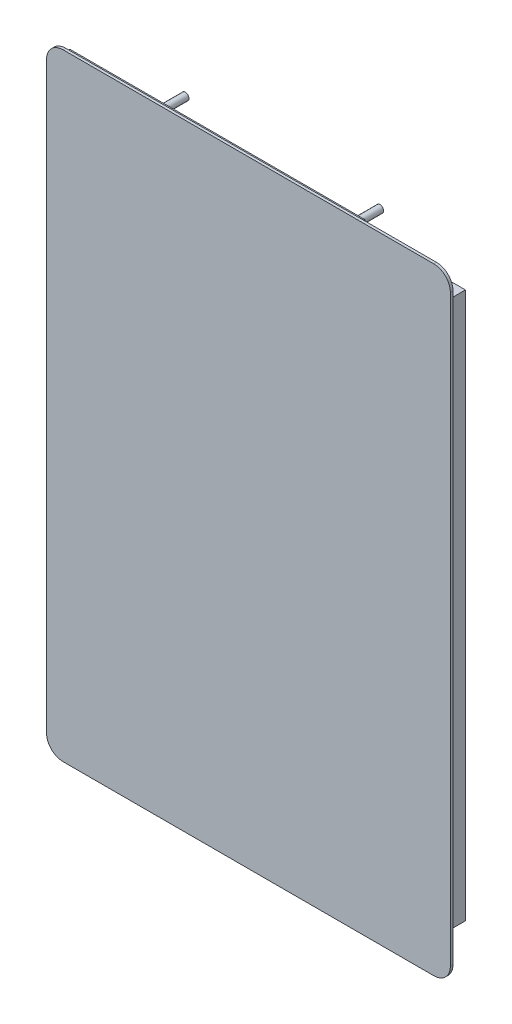
ISO-10303-21;
HEADER;
FILE_DESCRIPTION(('STEP AP214'),'2;1');
FILE_NAME('part.step','',(''),(''),'','','');
FILE_SCHEMA(('AUTOMOTIVE_DESIGN { 1 0 10303 214 1 1 1 1 }'));
ENDSEC;
DATA;
#1=APPLICATION_CONTEXT('core data for automotive mechanical design processes');
#2=APPLICATION_PROTOCOL_DEFINITION('international standard','automotive_design',2000,#1);
#3=PRODUCT_CONTEXT('',#1,'mechanical');
#4=PRODUCT('Part','Part','',(#3));
#5=PRODUCT_RELATED_PRODUCT_CATEGORY('part','',(#4));
#6=PRODUCT_DEFINITION_FORMATION('','',#4);
#7=PRODUCT_DEFINITION_CONTEXT('part definition',#1,'design');
#8=PRODUCT_DEFINITION('design','',#6,#7);
#9=PRODUCT_DEFINITION_SHAPE('','',#8);
#10=(LENGTH_UNIT() NAMED_UNIT(*) SI_UNIT(.MILLI.,.METRE.));
#11=(NAMED_UNIT(*) PLANE_ANGLE_UNIT() SI_UNIT($,.RADIAN.));
#12=(NAMED_UNIT(*) SI_UNIT($,.STERADIAN.) SOLID_ANGLE_UNIT());
#13=UNCERTAINTY_MEASURE_WITH_UNIT(LENGTH_MEASURE(1.E-05),#10,'distance_accuracy_value','');
#14=(GEOMETRIC_REPRESENTATION_CONTEXT(3) GLOBAL_UNCERTAINTY_ASSIGNED_CONTEXT((#13)) GLOBAL_UNIT_ASSIGNED_CONTEXT((#10,
#11,#12)) REPRESENTATION_CONTEXT('',''));
#15=CARTESIAN_POINT('',(0.,0.,0.));
#16=DIRECTION('',(0.,0.,1.));
#17=DIRECTION('',(1.,0.,0.));
#18=AXIS2_PLACEMENT_3D('',#15,#16,#17);
#19=CARTESIAN_POINT('',(76.67,120.67,0.));
#20=DIRECTION('',(0.,0.,-1.));
#21=DIRECTION('',(-1.,0.,0.));
#22=AXIS2_PLACEMENT_3D('',#19,#20,#21);
#23=PLANE('',#22);
#24=CARTESIAN_POINT('',(76.67,120.67,0.));
#25=DIRECTION('',(0.,0.,1.));
#26=DIRECTION('',(-1.,0.,0.));
#27=AXIS2_PLACEMENT_3D('',#24,#25,#26);
#28=CIRCLE('',#27,6.83);
#29=CARTESIAN_POINT('',(83.5,120.67,0.));
#30=VERTEX_POINT('',#29);
#31=CARTESIAN_POINT('',(76.6699999999999,127.5,0.));
#32=VERTEX_POINT('',#31);
#33=EDGE_CURVE('E255',#30,#32,#28,.T.);
#34=ORIENTED_EDGE('',*,*,#33,.F.);
#35=DIRECTION('',(0.,1.,0.));
#36=VECTOR('',#35,1.);
#37=CARTESIAN_POINT('',(83.5,-120.67,0.));
#38=LINE('',#37,#36);
#39=CARTESIAN_POINT('',(83.5,-120.67,0.));
#40=VERTEX_POINT('',#39);
#41=EDGE_CURVE('E261',#40,#30,#38,.T.);
#42=ORIENTED_EDGE('',*,*,#41,.F.);
#43=CARTESIAN_POINT('',(76.67,-120.67,0.));
#44=DIRECTION('',(0.,0.,1.));
#45=DIRECTION('',(1.,0.,0.));
#46=AXIS2_PLACEMENT_3D('',#43,#44,#45);
#47=CIRCLE('',#46,6.83);
#48=CARTESIAN_POINT('',(76.6699999999999,-127.5,0.));
#49=VERTEX_POINT('',#48);
#50=EDGE_CURVE('E301',#49,#40,#47,.T.);
#51=ORIENTED_EDGE('',*,*,#50,.F.);
#52=DIRECTION('',(1.,0.,0.));
#53=VECTOR('',#52,1.);
#54=CARTESIAN_POINT('',(-76.67,-127.5,0.));
#55=LINE('',#54,#53);
#56=CARTESIAN_POINT('',(-76.67,-127.5,0.));
#57=VERTEX_POINT('',#56);
#58=EDGE_CURVE('E298',#57,#49,#55,.T.);
#59=ORIENTED_EDGE('',*,*,#58,.F.);
#60=CARTESIAN_POINT('',(-76.67,-120.67,0.));
#61=DIRECTION('',(0.,0.,1.));
#62=DIRECTION('',(-1.,0.,0.));
#63=AXIS2_PLACEMENT_3D('',#60,#61,#62);
#64=CIRCLE('',#63,6.83);
#65=CARTESIAN_POINT('',(-83.5,-120.67,0.));
#66=VERTEX_POINT('',#65);
#67=EDGE_CURVE('E295',#66,#57,#64,.T.);
#68=ORIENTED_EDGE('',*,*,#67,.F.);
#69=DIRECTION('',(0.,-1.,0.));
#70=VECTOR('',#69,1.);
#71=CARTESIAN_POINT('',(-83.5,-120.67,0.));
#72=LINE('',#71,#70);
#73=CARTESIAN_POINT('',(-83.5,120.67,0.));
#74=VERTEX_POINT('',#73);
#75=EDGE_CURVE('E292',#74,#66,#72,.T.);
#76=ORIENTED_EDGE('',*,*,#75,.F.);
#77=CARTESIAN_POINT('',(-76.67,120.67,0.));
#78=DIRECTION('',(0.,0.,1.));
#79=DIRECTION('',(1.,0.,0.));
#80=AXIS2_PLACEMENT_3D('',#77,#78,#79);
#81=CIRCLE('',#80,6.83);
#82=CARTESIAN_POINT('',(-76.67,127.5,0.));
#83=VERTEX_POINT('',#82);
#84=EDGE_CURVE('E289',#83,#74,#81,.T.);
#85=ORIENTED_EDGE('',*,*,#84,.F.);
#86=DIRECTION('',(-1.,0.,0.));
#87=VECTOR('',#86,1.);
#88=CARTESIAN_POINT('',(-76.67,127.5,0.));
#89=LINE('',#88,#87);
#90=EDGE_CURVE('E286',#32,#83,#89,.T.);
#91=ORIENTED_EDGE('',*,*,#90,.F.);
#92=EDGE_LOOP('',(#34,#42,#51,#59,#68,#76,#85,#91));
#93=FACE_BOUND('',#92,.T.);
#94=DIRECTION('',(0.,-1.,0.));
#95=VECTOR('',#94,1.);
#96=CARTESIAN_POINT('',(78.04,113.,0.));
#97=LINE('',#96,#95);
#98=CARTESIAN_POINT('',(78.04,113.,0.));
#99=VERTEX_POINT('',#98);
#100=CARTESIAN_POINT('',(78.04,-113.,0.));
#101=VERTEX_POINT('',#100);
#102=EDGE_CURVE('E371',#99,#101,#97,.T.);
#103=ORIENTED_EDGE('',*,*,#102,.F.);
#104=DIRECTION('',(1.,0.,0.));
#105=VECTOR('',#104,1.);
#106=CARTESIAN_POINT('',(78.04,113.,0.));
#107=LINE('',#106,#105);
#108=CARTESIAN_POINT('',(46.04,113.,0.));
#109=VERTEX_POINT('',#108);
#110=EDGE_CURVE('E336',#109,#99,#107,.T.);
#111=ORIENTED_EDGE('',*,*,#110,.F.);
#112=DIRECTION('',(0.,-1.,0.));
#113=VECTOR('',#112,1.);
#114=CARTESIAN_POINT('',(46.04,127.,0.));
#115=LINE('',#114,#113);
#116=CARTESIAN_POINT('',(46.04,127.,0.));
#117=VERTEX_POINT('',#116);
#118=EDGE_CURVE('E82',#117,#109,#115,.T.);
#119=ORIENTED_EDGE('',*,*,#118,.F.);
#120=DIRECTION('',(1.,0.,0.));
#121=VECTOR('',#120,1.);
#122=CARTESIAN_POINT('',(46.04,127.,0.));
#123=LINE('',#122,#121);
#124=CARTESIAN_POINT('',(-75.96,127.,0.));
#125=VERTEX_POINT('',#124);
#126=EDGE_CURVE('E237',#125,#117,#123,.T.);
#127=ORIENTED_EDGE('',*,*,#126,.F.);
#128=DIRECTION('',(0.,1.,0.));
#129=VECTOR('',#128,1.);
#130=CARTESIAN_POINT('',(-75.96,127.,0.));
#131=LINE('',#130,#129);
#132=CARTESIAN_POINT('',(-75.96,-127.,0.));
#133=VERTEX_POINT('',#132);
#134=EDGE_CURVE('E233',#133,#125,#131,.T.);
#135=ORIENTED_EDGE('',*,*,#134,.F.);
#136=DIRECTION('',(-1.,0.,0.));
#137=VECTOR('',#136,1.);
#138=CARTESIAN_POINT('',(46.04,-127.,0.));
#139=LINE('',#138,#137);
#140=CARTESIAN_POINT('',(46.04,-127.,0.));
#141=VERTEX_POINT('',#140);
#142=EDGE_CURVE('E229',#141,#133,#139,.T.);
#143=ORIENTED_EDGE('',*,*,#142,.F.);
#144=CARTESIAN_POINT('',(46.04,-113.,0.));
#145=VERTEX_POINT('',#144);
#146=EDGE_CURVE('E204',#145,#141,#115,.T.);
#147=ORIENTED_EDGE('',*,*,#146,.F.);
#148=DIRECTION('',(-1.,0.,0.));
#149=VECTOR('',#148,1.);
#150=CARTESIAN_POINT('',(78.04,-113.,0.));
#151=LINE('',#150,#149);
#152=EDGE_CURVE('E198',#101,#145,#151,.T.);
#153=ORIENTED_EDGE('',*,*,#152,.F.);
#154=EDGE_LOOP('',(#103,#111,#119,#127,#135,#143,#147,#153));
#155=FACE_BOUND('',#154,.T.);
#156=ADVANCED_FACE('F56',(#93,#155),#23,.T.);
#157=CARTESIAN_POINT('',(46.04,127.,-1.));
#158=DIRECTION('',(-1.,0.,0.));
#159=DIRECTION('',(0.,-1.,0.));
#160=AXIS2_PLACEMENT_3D('',#157,#158,#159);
#161=PLANE('',#160);
#162=DIRECTION('',(0.,0.,1.));
#163=VECTOR('',#162,1.);
#164=CARTESIAN_POINT('',(46.04,113.,-10.6));
#165=LINE('',#164,#163);
#166=CARTESIAN_POINT('',(46.04,113.,-0.999999999999999));
#167=VERTEX_POINT('',#166);
#168=EDGE_CURVE('E205',#167,#109,#165,.T.);
#169=ORIENTED_EDGE('',*,*,#168,.F.);
#170=DIRECTION('',(0.,-1.,0.));
#171=VECTOR('',#170,1.);
#172=CARTESIAN_POINT('',(46.04,127.,-1.));
#173=LINE('',#172,#171);
#174=CARTESIAN_POINT('',(46.04,127.,-1.));
#175=VERTEX_POINT('',#174);
#176=EDGE_CURVE('E213',#175,#167,#173,.T.);
#177=ORIENTED_EDGE('',*,*,#176,.F.);
#178=DIRECTION('',(0.,0.,1.));
#179=VECTOR('',#178,1.);
#180=CARTESIAN_POINT('',(46.04,127.,-1.));
#181=LINE('',#180,#179);
#182=EDGE_CURVE('E226',#175,#117,#181,.T.);
#183=ORIENTED_EDGE('',*,*,#182,.T.);
#184=ORIENTED_EDGE('',*,*,#118,.T.);
#185=EDGE_LOOP('',(#169,#177,#183,#184));
#186=FACE_BOUND('',#185,.T.);
#187=ADVANCED_FACE('F405',(#186),#161,.F.);
#188=DIRECTION('',(0.,0.,1.));
#189=VECTOR('',#188,1.);
#190=CARTESIAN_POINT('',(46.04,-113.,-10.6));
#191=LINE('',#190,#189);
#192=CARTESIAN_POINT('',(46.04,-113.,-1.));
#193=VERTEX_POINT('',#192);
#194=EDGE_CURVE('E368',#193,#145,#191,.T.);
#195=ORIENTED_EDGE('',*,*,#194,.T.);
#196=ORIENTED_EDGE('',*,*,#146,.T.);
#197=DIRECTION('',(0.,0.,1.));
#198=VECTOR('',#197,1.);
#199=CARTESIAN_POINT('',(46.04,-127.,-1.));
#200=LINE('',#199,#198);
#201=CARTESIAN_POINT('',(46.04,-127.,-1.));
#202=VERTEX_POINT('',#201);
#203=EDGE_CURVE('E251',#202,#141,#200,.T.);
#204=ORIENTED_EDGE('',*,*,#203,.F.);
#205=EDGE_CURVE('E218',#193,#202,#173,.T.);
#206=ORIENTED_EDGE('',*,*,#205,.F.);
#207=EDGE_LOOP('',(#195,#196,#204,#206));
#208=FACE_BOUND('',#207,.T.);
#209=ADVANCED_FACE('F393',(#208),#161,.F.);
#210=CARTESIAN_POINT('',(76.67,120.67,1.1));
#211=DIRECTION('',(0.,0.,-1.));
#212=DIRECTION('',(-1.,0.,0.));
#213=AXIS2_PLACEMENT_3D('',#210,#211,#212);
#214=CYLINDRICAL_SURFACE('',#213,6.83);
#215=ORIENTED_EDGE('',*,*,#33,.T.);
#216=DIRECTION('',(0.,0.,-1.));
#217=VECTOR('',#216,1.);
#218=CARTESIAN_POINT('',(76.6699999999999,127.5,1.1));
#219=LINE('',#218,#217);
#220=CARTESIAN_POINT('',(76.6699999999999,127.5,1.1));
#221=VERTEX_POINT('',#220);
#222=EDGE_CURVE('E14',#221,#32,#219,.T.);
#223=ORIENTED_EDGE('',*,*,#222,.F.);
#224=CARTESIAN_POINT('',(76.67,120.67,1.1));
#225=DIRECTION('',(0.,0.,1.));
#226=DIRECTION('',(-1.,0.,0.));
#227=AXIS2_PLACEMENT_3D('',#224,#225,#226);
#228=CIRCLE('',#227,6.83);
#229=CARTESIAN_POINT('',(83.5,120.67,1.1));
#230=VERTEX_POINT('',#229);
#231=EDGE_CURVE('E256',#230,#221,#228,.T.);
#232=ORIENTED_EDGE('',*,*,#231,.F.);
#233=DIRECTION('',(0.,0.,-1.));
#234=VECTOR('',#233,1.);
#235=CARTESIAN_POINT('',(83.5,120.67,1.1));
#236=LINE('',#235,#234);
#237=EDGE_CURVE('E282',#230,#30,#236,.T.);
#238=ORIENTED_EDGE('',*,*,#237,.T.);
#239=EDGE_LOOP('',(#215,#223,#232,#238));
#240=FACE_BOUND('',#239,.T.);
#241=ADVANCED_FACE('F58',(#240),#214,.T.);
#242=CARTESIAN_POINT('',(-76.67,127.5,1.1));
#243=DIRECTION('',(0.,-1.,0.));
#244=DIRECTION('',(0.,0.,-1.));
#245=AXIS2_PLACEMENT_3D('',#242,#243,#244);
#246=PLANE('',#245);
#247=ORIENTED_EDGE('',*,*,#90,.T.);
#248=DIRECTION('',(0.,0.,-1.));
#249=VECTOR('',#248,1.);
#250=CARTESIAN_POINT('',(-76.67,127.5,1.1));
#251=LINE('',#250,#249);
#252=CARTESIAN_POINT('',(-76.67,127.5,1.1));
#253=VERTEX_POINT('',#252);
#254=EDGE_CURVE('E66',#253,#83,#251,.T.);
#255=ORIENTED_EDGE('',*,*,#254,.F.);
#256=DIRECTION('',(-1.,0.,0.));
#257=VECTOR('',#256,1.);
#258=CARTESIAN_POINT('',(-76.67,127.5,1.1));
#259=LINE('',#258,#257);
#260=EDGE_CURVE('E260',#221,#253,#259,.T.);
#261=ORIENTED_EDGE('',*,*,#260,.F.);
#262=ORIENTED_EDGE('',*,*,#222,.T.);
#263=EDGE_LOOP('',(#247,#255,#261,#262));
#264=FACE_BOUND('',#263,.T.);
#265=ADVANCED_FACE('F456',(#264),#246,.F.);
#266=CARTESIAN_POINT('',(-76.67,120.67,1.1));
#267=DIRECTION('',(0.,0.,-1.));
#268=DIRECTION('',(-1.,0.,0.));
#269=AXIS2_PLACEMENT_3D('',#266,#267,#268);
#270=CYLINDRICAL_SURFACE('',#269,6.83);
#271=ORIENTED_EDGE('',*,*,#84,.T.);
#272=DIRECTION('',(0.,0.,-1.));
#273=VECTOR('',#272,1.);
#274=CARTESIAN_POINT('',(-83.5,120.67,1.1));
#275=LINE('',#274,#273);
#276=CARTESIAN_POINT('',(-83.5,120.67,1.1));
#277=VERTEX_POINT('',#276);
#278=EDGE_CURVE('E325',#277,#74,#275,.T.);
#279=ORIENTED_EDGE('',*,*,#278,.F.);
#280=CARTESIAN_POINT('',(-76.67,120.67,1.1));
#281=DIRECTION('',(0.,0.,1.));
#282=DIRECTION('',(1.,0.,0.));
#283=AXIS2_PLACEMENT_3D('',#280,#281,#282);
#284=CIRCLE('',#283,6.83);
#285=EDGE_CURVE('E264',#253,#277,#284,.T.);
#286=ORIENTED_EDGE('',*,*,#285,.F.);
#287=ORIENTED_EDGE('',*,*,#254,.T.);
#288=EDGE_LOOP('',(#271,#279,#286,#287));
#289=FACE_BOUND('',#288,.T.);
#290=ADVANCED_FACE('F453',(#289),#270,.T.);
#291=CARTESIAN_POINT('',(-83.5,-120.67,1.1));
#292=DIRECTION('',(1.,0.,0.));
#293=DIRECTION('',(0.,0.,-1.));
#294=AXIS2_PLACEMENT_3D('',#291,#292,#293);
#295=PLANE('',#294);
#296=ORIENTED_EDGE('',*,*,#75,.T.);
#297=DIRECTION('',(0.,0.,-1.));
#298=VECTOR('',#297,1.);
#299=CARTESIAN_POINT('',(-83.5,-120.67,1.1));
#300=LINE('',#299,#298);
#301=CARTESIAN_POINT('',(-83.5,-120.67,1.1));
#302=VERTEX_POINT('',#301);
#303=EDGE_CURVE('E321',#302,#66,#300,.T.);
#304=ORIENTED_EDGE('',*,*,#303,.F.);
#305=DIRECTION('',(0.,-1.,0.));
#306=VECTOR('',#305,1.);
#307=CARTESIAN_POINT('',(-83.5,-120.67,1.1));
#308=LINE('',#307,#306);
#309=EDGE_CURVE('E267',#277,#302,#308,.T.);
#310=ORIENTED_EDGE('',*,*,#309,.F.);
#311=ORIENTED_EDGE('',*,*,#278,.T.);
#312=EDGE_LOOP('',(#296,#304,#310,#311));
#313=FACE_BOUND('',#312,.T.);
#314=ADVANCED_FACE('F449',(#313),#295,.F.);
#315=CARTESIAN_POINT('',(-76.67,-120.67,1.1));
#316=DIRECTION('',(0.,0.,-1.));
#317=DIRECTION('',(-1.,0.,0.));
#318=AXIS2_PLACEMENT_3D('',#315,#316,#317);
#319=CYLINDRICAL_SURFACE('',#318,6.83);
#320=ORIENTED_EDGE('',*,*,#67,.T.);
#321=DIRECTION('',(0.,0.,-1.));
#322=VECTOR('',#321,1.);
#323=CARTESIAN_POINT('',(-76.67,-127.5,1.1));
#324=LINE('',#323,#322);
#325=CARTESIAN_POINT('',(-76.67,-127.5,1.1));
#326=VERTEX_POINT('',#325);
#327=EDGE_CURVE('E317',#326,#57,#324,.T.);
#328=ORIENTED_EDGE('',*,*,#327,.F.);
#329=CARTESIAN_POINT('',(-76.67,-120.67,1.1));
#330=DIRECTION('',(0.,0.,1.));
#331=DIRECTION('',(-1.,0.,0.));
#332=AXIS2_PLACEMENT_3D('',#329,#330,#331);
#333=CIRCLE('',#332,6.83);
#334=EDGE_CURVE('E270',#302,#326,#333,.T.);
#335=ORIENTED_EDGE('',*,*,#334,.F.);
#336=ORIENTED_EDGE('',*,*,#303,.T.);
#337=EDGE_LOOP('',(#320,#328,#335,#336));
#338=FACE_BOUND('',#337,.T.);
#339=ADVANCED_FACE('F445',(#338),#319,.T.);
#340=CARTESIAN_POINT('',(-76.67,-127.5,1.1));
#341=DIRECTION('',(0.,1.,0.));
#342=DIRECTION('',(0.,0.,1.));
#343=AXIS2_PLACEMENT_3D('',#340,#341,#342);
#344=PLANE('',#343);
#345=ORIENTED_EDGE('',*,*,#58,.T.);
#346=DIRECTION('',(0.,0.,-1.));
#347=VECTOR('',#346,1.);
#348=CARTESIAN_POINT('',(76.6699999999999,-127.5,1.1));
#349=LINE('',#348,#347);
#350=CARTESIAN_POINT('',(76.6699999999999,-127.5,1.1));
#351=VERTEX_POINT('',#350);
#352=EDGE_CURVE('E313',#351,#49,#349,.T.);
#353=ORIENTED_EDGE('',*,*,#352,.F.);
#354=DIRECTION('',(1.,0.,0.));
#355=VECTOR('',#354,1.);
#356=CARTESIAN_POINT('',(-76.67,-127.5,1.1));
#357=LINE('',#356,#355);
#358=EDGE_CURVE('E273',#326,#351,#357,.T.);
#359=ORIENTED_EDGE('',*,*,#358,.F.);
#360=ORIENTED_EDGE('',*,*,#327,.T.);
#361=EDGE_LOOP('',(#345,#353,#359,#360));
#362=FACE_BOUND('',#361,.T.);
#363=ADVANCED_FACE('F441',(#362),#344,.F.);
#364=CARTESIAN_POINT('',(76.67,-120.67,1.1));
#365=DIRECTION('',(0.,0.,-1.));
#366=DIRECTION('',(-1.,0.,0.));
#367=AXIS2_PLACEMENT_3D('',#364,#365,#366);
#368=CYLINDRICAL_SURFACE('',#367,6.83);
#369=ORIENTED_EDGE('',*,*,#50,.T.);
#370=DIRECTION('',(0.,0.,-1.));
#371=VECTOR('',#370,1.);
#372=CARTESIAN_POINT('',(83.5,-120.67,1.1));
#373=LINE('',#372,#371);
#374=CARTESIAN_POINT('',(83.5,-120.67,1.1));
#375=VERTEX_POINT('',#374);
#376=EDGE_CURVE('E309',#375,#40,#373,.T.);
#377=ORIENTED_EDGE('',*,*,#376,.F.);
#378=CARTESIAN_POINT('',(76.67,-120.67,1.1));
#379=DIRECTION('',(0.,0.,1.));
#380=DIRECTION('',(1.,0.,0.));
#381=AXIS2_PLACEMENT_3D('',#378,#379,#380);
#382=CIRCLE('',#381,6.83);
#383=EDGE_CURVE('E276',#351,#375,#382,.T.);
#384=ORIENTED_EDGE('',*,*,#383,.F.);
#385=ORIENTED_EDGE('',*,*,#352,.T.);
#386=EDGE_LOOP('',(#369,#377,#384,#385));
#387=FACE_BOUND('',#386,.T.);
#388=ADVANCED_FACE('F437',(#387),#368,.T.);
#389=CARTESIAN_POINT('',(83.5,-120.67,1.1));
#390=DIRECTION('',(-1.,0.,0.));
#391=DIRECTION('',(0.,0.,1.));
#392=AXIS2_PLACEMENT_3D('',#389,#390,#391);
#393=PLANE('',#392);
#394=ORIENTED_EDGE('',*,*,#41,.T.);
#395=ORIENTED_EDGE('',*,*,#237,.F.);
#396=DIRECTION('',(0.,1.,0.));
#397=VECTOR('',#396,1.);
#398=CARTESIAN_POINT('',(83.5,-120.67,1.1));
#399=LINE('',#398,#397);
#400=EDGE_CURVE('E279',#375,#230,#399,.T.);
#401=ORIENTED_EDGE('',*,*,#400,.F.);
#402=ORIENTED_EDGE('',*,*,#376,.T.);
#403=EDGE_LOOP('',(#394,#395,#401,#402));
#404=FACE_BOUND('',#403,.T.);
#405=ADVANCED_FACE('F423',(#404),#393,.F.);
#406=CARTESIAN_POINT('',(76.67,120.67,1.1));
#407=DIRECTION('',(0.,0.,-1.));
#408=DIRECTION('',(-1.,0.,0.));
#409=AXIS2_PLACEMENT_3D('',#406,#407,#408);
#410=PLANE('',#409);
#411=ORIENTED_EDGE('',*,*,#231,.T.);
#412=ORIENTED_EDGE('',*,*,#260,.T.);
#413=ORIENTED_EDGE('',*,*,#285,.T.);
#414=ORIENTED_EDGE('',*,*,#309,.T.);
#415=ORIENTED_EDGE('',*,*,#334,.T.);
#416=ORIENTED_EDGE('',*,*,#358,.T.);
#417=ORIENTED_EDGE('',*,*,#383,.T.);
#418=ORIENTED_EDGE('',*,*,#400,.T.);
#419=EDGE_LOOP('',(#411,#412,#413,#414,#415,#416,#417,#418));
#420=FACE_BOUND('',#419,.T.);
#421=ADVANCED_FACE('F416',(#420),#410,.F.);
#422=CARTESIAN_POINT('',(46.04,-127.,-1.));
#423=DIRECTION('',(0.,1.,0.));
#424=DIRECTION('',(-1.,0.,0.));
#425=AXIS2_PLACEMENT_3D('',#422,#423,#424);
#426=PLANE('',#425);
#427=ORIENTED_EDGE('',*,*,#142,.T.);
#428=DIRECTION('',(0.,0.,1.));
#429=VECTOR('',#428,1.);
#430=CARTESIAN_POINT('',(-75.96,-127.,-1.));
#431=LINE('',#430,#429);
#432=CARTESIAN_POINT('',(-75.96,-127.,-1.));
#433=VERTEX_POINT('',#432);
#434=EDGE_CURVE('E247',#433,#133,#431,.T.);
#435=ORIENTED_EDGE('',*,*,#434,.F.);
#436=DIRECTION('',(-1.,0.,0.));
#437=VECTOR('',#436,1.);
#438=CARTESIAN_POINT('',(46.04,-127.,-1.));
#439=LINE('',#438,#437);
#440=EDGE_CURVE('E217',#202,#433,#439,.T.);
#441=ORIENTED_EDGE('',*,*,#440,.F.);
#442=ORIENTED_EDGE('',*,*,#203,.T.);
#443=EDGE_LOOP('',(#427,#435,#441,#442));
#444=FACE_BOUND('',#443,.T.);
#445=ADVANCED_FACE('F414',(#444),#426,.F.);
#446=CARTESIAN_POINT('',(-75.96,127.,-1.));
#447=DIRECTION('',(1.,0.,0.));
#448=DIRECTION('',(0.,1.,0.));
#449=AXIS2_PLACEMENT_3D('',#446,#447,#448);
#450=PLANE('',#449);
#451=ORIENTED_EDGE('',*,*,#134,.T.);
#452=DIRECTION('',(0.,0.,1.));
#453=VECTOR('',#452,1.);
#454=CARTESIAN_POINT('',(-75.96,127.,-1.));
#455=LINE('',#454,#453);
#456=CARTESIAN_POINT('',(-75.96,127.,-1.));
#457=VERTEX_POINT('',#456);
#458=EDGE_CURVE('E243',#457,#125,#455,.T.);
#459=ORIENTED_EDGE('',*,*,#458,.F.);
#460=DIRECTION('',(0.,1.,0.));
#461=VECTOR('',#460,1.);
#462=CARTESIAN_POINT('',(-75.96,127.,-1.));
#463=LINE('',#462,#461);
#464=EDGE_CURVE('E221',#433,#457,#463,.T.);
#465=ORIENTED_EDGE('',*,*,#464,.F.);
#466=ORIENTED_EDGE('',*,*,#434,.T.);
#467=EDGE_LOOP('',(#451,#459,#465,#466));
#468=FACE_BOUND('',#467,.T.);
#469=ADVANCED_FACE('F410',(#468),#450,.F.);
#470=CARTESIAN_POINT('',(46.04,127.,-1.));
#471=DIRECTION('',(0.,-1.,0.));
#472=DIRECTION('',(0.,0.,-1.));
#473=AXIS2_PLACEMENT_3D('',#470,#471,#472);
#474=PLANE('',#473);
#475=ORIENTED_EDGE('',*,*,#126,.T.);
#476=ORIENTED_EDGE('',*,*,#182,.F.);
#477=DIRECTION('',(1.,0.,0.));
#478=VECTOR('',#477,1.);
#479=CARTESIAN_POINT('',(46.04,127.,-1.));
#480=LINE('',#479,#478);
#481=EDGE_CURVE('E224',#457,#175,#480,.T.);
#482=ORIENTED_EDGE('',*,*,#481,.F.);
#483=ORIENTED_EDGE('',*,*,#458,.T.);
#484=EDGE_LOOP('',(#475,#476,#482,#483));
#485=FACE_BOUND('',#484,.T.);
#486=ADVANCED_FACE('F407',(#485),#474,.F.);
#487=CARTESIAN_POINT('',(0.,0.,-1.));
#488=DIRECTION('',(0.,0.,-1.));
#489=DIRECTION('',(-1.,0.,0.));
#490=AXIS2_PLACEMENT_3D('',#487,#488,#489);
#491=PLANE('',#490);
#492=CARTESIAN_POINT('',(23.21,104.9,-1.));
#493=DIRECTION('',(0.,0.,-1.));
#494=DIRECTION('',(-1.,0.,0.));
#495=AXIS2_PLACEMENT_3D('',#492,#493,#494);
#496=CIRCLE('',#495,1.5);
#497=CARTESIAN_POINT('',(21.71,104.9,-1.));
#498=VERTEX_POINT('',#497);
#499=EDGE_CURVE('E60',#498,#498,#496,.F.);
#500=ORIENTED_EDGE('',*,*,#499,.T.);
#501=EDGE_LOOP('',(#500));
#502=FACE_BOUND('',#501,.T.);
#503=CARTESIAN_POINT('',(-57.3,104.9,-1.));
#504=DIRECTION('',(0.,0.,-1.));
#505=DIRECTION('',(-1.,0.,0.));
#506=AXIS2_PLACEMENT_3D('',#503,#504,#505);
#507=CIRCLE('',#506,1.5);
#508=CARTESIAN_POINT('',(-58.8,104.9,-1.));
#509=VERTEX_POINT('',#508);
#510=EDGE_CURVE('E342',#509,#509,#507,.F.);
#511=ORIENTED_EDGE('',*,*,#510,.T.);
#512=EDGE_LOOP('',(#511));
#513=FACE_BOUND('',#512,.T.);
#514=CARTESIAN_POINT('',(-57.3,-104.9,-1.));
#515=DIRECTION('',(0.,0.,-1.));
#516=DIRECTION('',(-1.,0.,0.));
#517=AXIS2_PLACEMENT_3D('',#514,#515,#516);
#518=CIRCLE('',#517,1.5);
#519=CARTESIAN_POINT('',(-58.8,-104.9,-1.));
#520=VERTEX_POINT('',#519);
#521=EDGE_CURVE('E338',#520,#520,#518,.F.);
#522=ORIENTED_EDGE('',*,*,#521,.T.);
#523=EDGE_LOOP('',(#522));
#524=FACE_BOUND('',#523,.T.);
#525=CARTESIAN_POINT('',(23.21,-104.9,-1.));
#526=DIRECTION('',(0.,0.,-1.));
#527=DIRECTION('',(-1.,0.,0.));
#528=AXIS2_PLACEMENT_3D('',#525,#526,#527);
#529=CIRCLE('',#528,1.5);
#530=CARTESIAN_POINT('',(21.71,-104.9,-1.));
#531=VERTEX_POINT('',#530);
#532=EDGE_CURVE('E332',#531,#531,#529,.F.);
#533=ORIENTED_EDGE('',*,*,#532,.T.);
#534=EDGE_LOOP('',(#533));
#535=FACE_BOUND('',#534,.T.);
#536=ORIENTED_EDGE('',*,*,#176,.T.);
#537=EDGE_CURVE('E202',#167,#193,#173,.T.);
#538=ORIENTED_EDGE('',*,*,#537,.T.);
#539=ORIENTED_EDGE('',*,*,#205,.T.);
#540=ORIENTED_EDGE('',*,*,#440,.T.);
#541=ORIENTED_EDGE('',*,*,#464,.T.);
#542=ORIENTED_EDGE('',*,*,#481,.T.);
#543=EDGE_LOOP('',(#536,#538,#539,#540,#541,#542));
#544=FACE_BOUND('',#543,.T.);
#545=ADVANCED_FACE('F399',(#502,#513,#524,#535,#544),#491,.T.);
#546=CARTESIAN_POINT('',(46.04,113.,-10.6));
#547=DIRECTION('',(1.,0.,0.));
#548=DIRECTION('',(0.,0.,-1.));
#549=AXIS2_PLACEMENT_3D('',#546,#547,#548);
#550=PLANE('',#549);
#551=ORIENTED_EDGE('',*,*,#537,.F.);
#552=CARTESIAN_POINT('',(46.04,113.,-10.6));
#553=VERTEX_POINT('',#552);
#554=EDGE_CURVE('E184',#553,#167,#165,.T.);
#555=ORIENTED_EDGE('',*,*,#554,.F.);
#556=DIRECTION('',(0.,1.,0.));
#557=VECTOR('',#556,1.);
#558=CARTESIAN_POINT('',(46.04,113.,-10.6));
#559=LINE('',#558,#557);
#560=CARTESIAN_POINT('',(46.04,-113.,-10.6));
#561=VERTEX_POINT('',#560);
#562=EDGE_CURVE('E192',#561,#553,#559,.T.);
#563=ORIENTED_EDGE('',*,*,#562,.F.);
#564=EDGE_CURVE('E74',#561,#193,#191,.T.);
#565=ORIENTED_EDGE('',*,*,#564,.T.);
#566=EDGE_LOOP('',(#551,#555,#563,#565));
#567=FACE_BOUND('',#566,.T.);
#568=ADVANCED_FACE('F200',(#567),#550,.F.);
#569=CARTESIAN_POINT('',(78.04,113.,-10.6));
#570=DIRECTION('',(0.,-1.,0.));
#571=DIRECTION('',(0.,0.,-1.));
#572=AXIS2_PLACEMENT_3D('',#569,#570,#571);
#573=PLANE('',#572);
#574=ORIENTED_EDGE('',*,*,#110,.T.);
#575=DIRECTION('',(0.,0.,1.));
#576=VECTOR('',#575,1.);
#577=CARTESIAN_POINT('',(78.04,113.,-10.6));
#578=LINE('',#577,#576);
#579=CARTESIAN_POINT('',(78.04,113.,-10.6));
#580=VERTEX_POINT('',#579);
#581=EDGE_CURVE('E187',#580,#99,#578,.T.);
#582=ORIENTED_EDGE('',*,*,#581,.F.);
#583=DIRECTION('',(1.,0.,0.));
#584=VECTOR('',#583,1.);
#585=CARTESIAN_POINT('',(78.04,113.,-10.6));
#586=LINE('',#585,#584);
#587=EDGE_CURVE('E180',#553,#580,#586,.T.);
#588=ORIENTED_EDGE('',*,*,#587,.F.);
#589=ORIENTED_EDGE('',*,*,#554,.T.);
#590=ORIENTED_EDGE('',*,*,#168,.T.);
#591=EDGE_LOOP('',(#574,#582,#588,#589,#590));
#592=FACE_BOUND('',#591,.T.);
#593=ADVANCED_FACE('F182',(#592),#573,.F.);
#594=CARTESIAN_POINT('',(78.04,113.,-10.6));
#595=DIRECTION('',(-1.,0.,0.));
#596=DIRECTION('',(0.,-1.,0.));
#597=AXIS2_PLACEMENT_3D('',#594,#595,#596);
#598=PLANE('',#597);
#599=ORIENTED_EDGE('',*,*,#102,.T.);
#600=DIRECTION('',(0.,0.,1.));
#601=VECTOR('',#600,1.);
#602=CARTESIAN_POINT('',(78.04,-113.,-10.6));
#603=LINE('',#602,#601);
#604=CARTESIAN_POINT('',(78.04,-113.,-10.6));
#605=VERTEX_POINT('',#604);
#606=EDGE_CURVE('E377',#605,#101,#603,.T.);
#607=ORIENTED_EDGE('',*,*,#606,.F.);
#608=DIRECTION('',(0.,-1.,0.));
#609=VECTOR('',#608,1.);
#610=CARTESIAN_POINT('',(78.04,113.,-10.6));
#611=LINE('',#610,#609);
#612=EDGE_CURVE('E191',#580,#605,#611,.T.);
#613=ORIENTED_EDGE('',*,*,#612,.F.);
#614=ORIENTED_EDGE('',*,*,#581,.T.);
#615=EDGE_LOOP('',(#599,#607,#613,#614));
#616=FACE_BOUND('',#615,.T.);
#617=ADVANCED_FACE('F386',(#616),#598,.F.);
#618=CARTESIAN_POINT('',(78.04,-113.,-10.6));
#619=DIRECTION('',(0.,1.,0.));
#620=DIRECTION('',(0.,0.,1.));
#621=AXIS2_PLACEMENT_3D('',#618,#619,#620);
#622=PLANE('',#621);
#623=ORIENTED_EDGE('',*,*,#152,.T.);
#624=ORIENTED_EDGE('',*,*,#194,.F.);
#625=ORIENTED_EDGE('',*,*,#564,.F.);
#626=DIRECTION('',(-1.,0.,0.));
#627=VECTOR('',#626,1.);
#628=CARTESIAN_POINT('',(78.04,-113.,-10.6));
#629=LINE('',#628,#627);
#630=EDGE_CURVE('E196',#605,#561,#629,.T.);
#631=ORIENTED_EDGE('',*,*,#630,.F.);
#632=ORIENTED_EDGE('',*,*,#606,.T.);
#633=EDGE_LOOP('',(#623,#624,#625,#631,#632));
#634=FACE_BOUND('',#633,.T.);
#635=ADVANCED_FACE('F390',(#634),#622,.F.);
#636=CARTESIAN_POINT('',(0.,0.,-10.6));
#637=DIRECTION('',(0.,0.,-1.));
#638=DIRECTION('',(-1.,0.,0.));
#639=AXIS2_PLACEMENT_3D('',#636,#637,#638);
#640=PLANE('',#639);
#641=ORIENTED_EDGE('',*,*,#562,.T.);
#642=ORIENTED_EDGE('',*,*,#587,.T.);
#643=ORIENTED_EDGE('',*,*,#612,.T.);
#644=ORIENTED_EDGE('',*,*,#630,.T.);
#645=EDGE_LOOP('',(#641,#642,#643,#644));
#646=FACE_BOUND('',#645,.T.);
#647=ADVANCED_FACE('F194',(#646),#640,.T.);
#648=CARTESIAN_POINT('',(23.21,-104.9,-65.5426406871193));
#649=DIRECTION('',(0.,0.,1.));
#650=DIRECTION('',(1.,0.,0.));
#651=AXIS2_PLACEMENT_3D('',#648,#649,#650);
#652=CYLINDRICAL_SURFACE('',#651,1.5);
#653=ORIENTED_EDGE('',*,*,#532,.F.);
#654=EDGE_LOOP('',(#653));
#655=FACE_BOUND('',#654,.T.);
#656=CARTESIAN_POINT('',(23.21,-104.9,-30.1));
#657=DIRECTION('',(0.,0.,-1.));
#658=DIRECTION('',(-1.,0.,0.));
#659=AXIS2_PLACEMENT_3D('',#656,#657,#658);
#660=CIRCLE('',#659,1.5);
#661=CARTESIAN_POINT('',(21.71,-104.9,-30.1));
#662=VERTEX_POINT('',#661);
#663=EDGE_CURVE('E337',#662,#662,#660,.T.);
#664=ORIENTED_EDGE('',*,*,#663,.F.);
#665=EDGE_LOOP('',(#664));
#666=FACE_BOUND('',#665,.T.);
#667=ADVANCED_FACE('F621',(#655,#666),#652,.T.);
#668=CARTESIAN_POINT('',(76.67,120.67,-30.1));
#669=DIRECTION('',(0.,0.,-1.));
#670=DIRECTION('',(-1.,0.,0.));
#671=AXIS2_PLACEMENT_3D('',#668,#669,#670);
#672=PLANE('',#671);
#673=ORIENTED_EDGE('',*,*,#663,.T.);
#674=EDGE_LOOP('',(#673));
#675=FACE_BOUND('',#674,.T.);
#676=ADVANCED_FACE('F627',(#675),#672,.T.);
#677=CARTESIAN_POINT('',(-57.3,-104.9,-65.5426406871193));
#678=DIRECTION('',(0.,0.,1.));
#679=DIRECTION('',(1.,0.,0.));
#680=AXIS2_PLACEMENT_3D('',#677,#678,#679);
#681=CYLINDRICAL_SURFACE('',#680,1.5);
#682=ORIENTED_EDGE('',*,*,#521,.F.);
#683=EDGE_LOOP('',(#682));
#684=FACE_BOUND('',#683,.T.);
#685=CARTESIAN_POINT('',(-57.3,-104.9,-30.1));
#686=DIRECTION('',(0.,0.,-1.));
#687=DIRECTION('',(-1.,0.,0.));
#688=AXIS2_PLACEMENT_3D('',#685,#686,#687);
#689=CIRCLE('',#688,1.5);
#690=CARTESIAN_POINT('',(-58.8,-104.9,-30.1));
#691=VERTEX_POINT('',#690);
#692=EDGE_CURVE('E341',#691,#691,#689,.T.);
#693=ORIENTED_EDGE('',*,*,#692,.F.);
#694=EDGE_LOOP('',(#693));
#695=FACE_BOUND('',#694,.T.);
#696=ADVANCED_FACE('F635',(#684,#695),#681,.T.);
#697=CARTESIAN_POINT('',(76.67,120.67,-30.1));
#698=DIRECTION('',(0.,0.,-1.));
#699=DIRECTION('',(-1.,0.,0.));
#700=AXIS2_PLACEMENT_3D('',#697,#698,#699);
#701=PLANE('',#700);
#702=ORIENTED_EDGE('',*,*,#692,.T.);
#703=EDGE_LOOP('',(#702));
#704=FACE_BOUND('',#703,.T.);
#705=ADVANCED_FACE('F643',(#704),#701,.T.);
#706=CARTESIAN_POINT('',(-57.3,104.9,-65.5426406871193));
#707=DIRECTION('',(0.,0.,1.));
#708=DIRECTION('',(1.,0.,0.));
#709=AXIS2_PLACEMENT_3D('',#706,#707,#708);
#710=CYLINDRICAL_SURFACE('',#709,1.5);
#711=ORIENTED_EDGE('',*,*,#510,.F.);
#712=EDGE_LOOP('',(#711));
#713=FACE_BOUND('',#712,.T.);
#714=CARTESIAN_POINT('',(-57.3,104.9,-30.1));
#715=DIRECTION('',(0.,0.,-1.));
#716=DIRECTION('',(-1.,0.,0.));
#717=AXIS2_PLACEMENT_3D('',#714,#715,#716);
#718=CIRCLE('',#717,1.5);
#719=CARTESIAN_POINT('',(-58.8,104.9,-30.1));
#720=VERTEX_POINT('',#719);
#721=EDGE_CURVE('E345',#720,#720,#718,.T.);
#722=ORIENTED_EDGE('',*,*,#721,.F.);
#723=EDGE_LOOP('',(#722));
#724=FACE_BOUND('',#723,.T.);
#725=ADVANCED_FACE('F651',(#713,#724),#710,.T.);
#726=CARTESIAN_POINT('',(76.67,120.67,-30.1));
#727=DIRECTION('',(0.,0.,-1.));
#728=DIRECTION('',(-1.,0.,0.));
#729=AXIS2_PLACEMENT_3D('',#726,#727,#728);
#730=PLANE('',#729);
#731=ORIENTED_EDGE('',*,*,#721,.T.);
#732=EDGE_LOOP('',(#731));
#733=FACE_BOUND('',#732,.T.);
#734=ADVANCED_FACE('F659',(#733),#730,.T.);
#735=CARTESIAN_POINT('',(23.21,104.9,-65.5426406871193));
#736=DIRECTION('',(0.,0.,1.));
#737=DIRECTION('',(1.,0.,0.));
#738=AXIS2_PLACEMENT_3D('',#735,#736,#737);
#739=CYLINDRICAL_SURFACE('',#738,1.5);
#740=ORIENTED_EDGE('',*,*,#499,.F.);
#741=EDGE_LOOP('',(#740));
#742=FACE_BOUND('',#741,.T.);
#743=CARTESIAN_POINT('',(23.21,104.9,-30.1));
#744=DIRECTION('',(0.,0.,-1.));
#745=DIRECTION('',(-1.,0.,0.));
#746=AXIS2_PLACEMENT_3D('',#743,#744,#745);
#747=CIRCLE('',#746,1.5);
#748=CARTESIAN_POINT('',(21.71,104.9,-30.1));
#749=VERTEX_POINT('',#748);
#750=EDGE_CURVE('E358',#749,#749,#747,.T.);
#751=ORIENTED_EDGE('',*,*,#750,.F.);
#752=EDGE_LOOP('',(#751));
#753=FACE_BOUND('',#752,.T.);
#754=ADVANCED_FACE('F667',(#742,#753),#739,.T.);
#755=CARTESIAN_POINT('',(76.67,120.67,-30.1));
#756=DIRECTION('',(0.,0.,-1.));
#757=DIRECTION('',(-1.,0.,0.));
#758=AXIS2_PLACEMENT_3D('',#755,#756,#757);
#759=PLANE('',#758);
#760=ORIENTED_EDGE('',*,*,#750,.T.);
#761=EDGE_LOOP('',(#760));
#762=FACE_BOUND('',#761,.T.);
#763=ADVANCED_FACE('F674',(#762),#759,.T.);
#764=CLOSED_SHELL('',(#156,#187,#209,#241,#265,#290,#314,#339,#363,#388,#405,#421,#445,#469,
#486,#545,#568,#593,#617,#635,#647,#667,#676,#696,#705,#725,#734,#754,#763));
#765=MANIFOLD_SOLID_BREP('B2',#764);
#766=ADVANCED_BREP_SHAPE_REPRESENTATION('',(#18,#765),#14);
#767=SHAPE_DEFINITION_REPRESENTATION(#9,#766);
ENDSEC;
END-ISO-10303-21;
